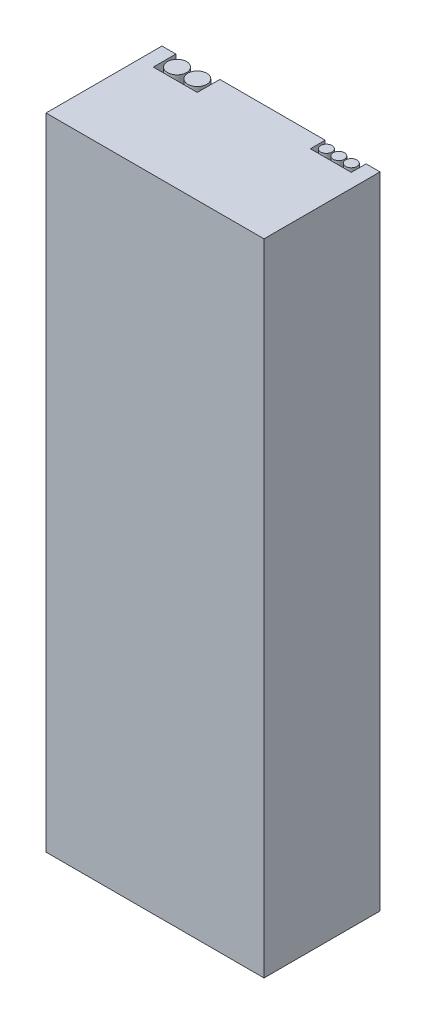
ISO-10303-21;
HEADER;
FILE_DESCRIPTION(('STEP AP214'),'2;1');
FILE_NAME('part.step','',(''),(''),'','','');
FILE_SCHEMA(('AUTOMOTIVE_DESIGN { 1 0 10303 214 1 1 1 1 }'));
ENDSEC;
DATA;
#1=APPLICATION_CONTEXT('core data for automotive mechanical design processes');
#2=APPLICATION_PROTOCOL_DEFINITION('international standard','automotive_design',2000,#1);
#3=PRODUCT_CONTEXT('',#1,'mechanical');
#4=PRODUCT('Part','Part','',(#3));
#5=PRODUCT_RELATED_PRODUCT_CATEGORY('part','',(#4));
#6=PRODUCT_DEFINITION_FORMATION('','',#4);
#7=PRODUCT_DEFINITION_CONTEXT('part definition',#1,'design');
#8=PRODUCT_DEFINITION('design','',#6,#7);
#9=PRODUCT_DEFINITION_SHAPE('','',#8);
#10=(LENGTH_UNIT() NAMED_UNIT(*) SI_UNIT(.MILLI.,.METRE.));
#11=(NAMED_UNIT(*) PLANE_ANGLE_UNIT() SI_UNIT($,.RADIAN.));
#12=(NAMED_UNIT(*) SI_UNIT($,.STERADIAN.) SOLID_ANGLE_UNIT());
#13=UNCERTAINTY_MEASURE_WITH_UNIT(LENGTH_MEASURE(1.E-05),#10,'distance_accuracy_value','');
#14=(GEOMETRIC_REPRESENTATION_CONTEXT(3) GLOBAL_UNCERTAINTY_ASSIGNED_CONTEXT((#13)) GLOBAL_UNIT_ASSIGNED_CONTEXT((#10,
#11,#12)) REPRESENTATION_CONTEXT('',''));
#15=CARTESIAN_POINT('',(0.,0.,0.));
#16=DIRECTION('',(0.,0.,1.));
#17=DIRECTION('',(1.,0.,0.));
#18=AXIS2_PLACEMENT_3D('',#15,#16,#17);
#19=CARTESIAN_POINT('',(0.,138.,-25.));
#20=DIRECTION('',(0.,0.,1.));
#21=DIRECTION('',(1.,0.,0.));
#22=AXIS2_PLACEMENT_3D('',#19,#20,#21);
#23=PLANE('',#22);
#24=DIRECTION('',(0.,1.,0.));
#25=VECTOR('',#24,1.);
#26=CARTESIAN_POINT('',(12.48,131.,-25.));
#27=LINE('',#26,#25);
#28=CARTESIAN_POINT('',(12.48,131.,-25.));
#29=VERTEX_POINT('',#28);
#30=CARTESIAN_POINT('',(12.48,138.,-25.));
#31=VERTEX_POINT('',#30);
#32=EDGE_CURVE('E231',#29,#31,#27,.T.);
#33=ORIENTED_EDGE('',*,*,#32,.T.);
#34=DIRECTION('',(-1.,0.,0.));
#35=VECTOR('',#34,1.);
#36=CARTESIAN_POINT('',(0.,138.,-25.));
#37=LINE('',#36,#35);
#38=CARTESIAN_POINT('',(35.18,138.,-25.));
#39=VERTEX_POINT('',#38);
#40=EDGE_CURVE('E352',#39,#31,#37,.T.);
#41=ORIENTED_EDGE('',*,*,#40,.F.);
#42=DIRECTION('',(0.,1.,0.));
#43=VECTOR('',#42,1.);
#44=CARTESIAN_POINT('',(35.18,131.,-25.));
#45=LINE('',#44,#43);
#46=CARTESIAN_POINT('',(35.18,131.,-25.));
#47=VERTEX_POINT('',#46);
#48=EDGE_CURVE('E150',#47,#39,#45,.T.);
#49=ORIENTED_EDGE('',*,*,#48,.F.);
#50=DIRECTION('',(-1.,0.,0.));
#51=VECTOR('',#50,1.);
#52=CARTESIAN_POINT('',(44.,131.,-25.));
#53=LINE('',#52,#51);
#54=CARTESIAN_POINT('',(44.,131.,-25.));
#55=VERTEX_POINT('',#54);
#56=EDGE_CURVE('E284',#55,#47,#53,.T.);
#57=ORIENTED_EDGE('',*,*,#56,.F.);
#58=DIRECTION('',(0.,1.,0.));
#59=VECTOR('',#58,1.);
#60=CARTESIAN_POINT('',(44.,131.,-25.));
#61=LINE('',#60,#59);
#62=CARTESIAN_POINT('',(44.,138.,-25.));
#63=VERTEX_POINT('',#62);
#64=EDGE_CURVE('E280',#55,#63,#61,.T.);
#65=ORIENTED_EDGE('',*,*,#64,.T.);
#66=CARTESIAN_POINT('',(47.,138.,-25.));
#67=VERTEX_POINT('',#66);
#68=EDGE_CURVE('E347',#67,#63,#37,.T.);
#69=ORIENTED_EDGE('',*,*,#68,.F.);
#70=DIRECTION('',(0.,-1.,0.));
#71=VECTOR('',#70,1.);
#72=CARTESIAN_POINT('',(47.,138.,-25.));
#73=LINE('',#72,#71);
#74=CARTESIAN_POINT('',(47.,0.,-25.));
#75=VERTEX_POINT('',#74);
#76=EDGE_CURVE('E367',#67,#75,#73,.T.);
#77=ORIENTED_EDGE('',*,*,#76,.T.);
#78=DIRECTION('',(-1.,0.,0.));
#79=VECTOR('',#78,1.);
#80=CARTESIAN_POINT('',(0.,0.,-25.));
#81=LINE('',#80,#79);
#82=CARTESIAN_POINT('',(0.,0.,-25.));
#83=VERTEX_POINT('',#82);
#84=EDGE_CURVE('E340',#75,#83,#81,.T.);
#85=ORIENTED_EDGE('',*,*,#84,.T.);
#86=DIRECTION('',(0.,-1.,0.));
#87=VECTOR('',#86,1.);
#88=CARTESIAN_POINT('',(0.,138.,-25.));
#89=LINE('',#88,#87);
#90=CARTESIAN_POINT('',(0.,138.,-25.));
#91=VERTEX_POINT('',#90);
#92=EDGE_CURVE('E351',#91,#83,#89,.T.);
#93=ORIENTED_EDGE('',*,*,#92,.F.);
#94=CARTESIAN_POINT('',(3.,138.,-25.));
#95=VERTEX_POINT('',#94);
#96=EDGE_CURVE('E346',#95,#91,#37,.T.);
#97=ORIENTED_EDGE('',*,*,#96,.F.);
#98=DIRECTION('',(0.,1.,0.));
#99=VECTOR('',#98,1.);
#100=CARTESIAN_POINT('',(3.,131.,-25.));
#101=LINE('',#100,#99);
#102=CARTESIAN_POINT('',(3.,131.,-25.));
#103=VERTEX_POINT('',#102);
#104=EDGE_CURVE('E142',#103,#95,#101,.T.);
#105=ORIENTED_EDGE('',*,*,#104,.F.);
#106=DIRECTION('',(1.,0.,0.));
#107=VECTOR('',#106,1.);
#108=CARTESIAN_POINT('',(3.,131.,-25.));
#109=LINE('',#108,#107);
#110=EDGE_CURVE('E223',#103,#29,#109,.T.);
#111=ORIENTED_EDGE('',*,*,#110,.T.);
#112=EDGE_LOOP('',(#33,#41,#49,#57,#65,#69,#77,#85,#93,#97,#105,#111));
#113=FACE_BOUND('',#112,.T.);
#114=ADVANCED_FACE('F126',(#113),#23,.F.);
#115=CARTESIAN_POINT('',(0.,138.,0.));
#116=DIRECTION('',(0.,-1.,0.));
#117=DIRECTION('',(0.,0.,-1.));
#118=AXIS2_PLACEMENT_3D('',#115,#116,#117);
#119=PLANE('',#118);
#120=DIRECTION('',(0.,0.,1.));
#121=VECTOR('',#120,1.);
#122=CARTESIAN_POINT('',(12.48,138.,-25.));
#123=LINE('',#122,#121);
#124=CARTESIAN_POINT('',(12.48,138.,-20.135));
#125=VERTEX_POINT('',#124);
#126=EDGE_CURVE('E234',#31,#125,#123,.T.);
#127=ORIENTED_EDGE('',*,*,#126,.T.);
#128=DIRECTION('',(1.,0.,0.));
#129=VECTOR('',#128,1.);
#130=CARTESIAN_POINT('',(3.,138.,-20.135));
#131=LINE('',#130,#129);
#132=CARTESIAN_POINT('',(3.,138.,-20.135));
#133=VERTEX_POINT('',#132);
#134=EDGE_CURVE('E247',#133,#125,#131,.T.);
#135=ORIENTED_EDGE('',*,*,#134,.F.);
#136=DIRECTION('',(0.,0.,1.));
#137=VECTOR('',#136,1.);
#138=CARTESIAN_POINT('',(3.,138.,-25.));
#139=LINE('',#138,#137);
#140=EDGE_CURVE('E244',#95,#133,#139,.T.);
#141=ORIENTED_EDGE('',*,*,#140,.F.);
#142=ORIENTED_EDGE('',*,*,#96,.T.);
#143=DIRECTION('',(0.,0.,1.));
#144=VECTOR('',#143,1.);
#145=CARTESIAN_POINT('',(0.,138.,0.));
#146=LINE('',#145,#144);
#147=CARTESIAN_POINT('',(0.,138.,0.));
#148=VERTEX_POINT('',#147);
#149=EDGE_CURVE('E335',#91,#148,#146,.T.);
#150=ORIENTED_EDGE('',*,*,#149,.T.);
#151=DIRECTION('',(1.,0.,0.));
#152=VECTOR('',#151,1.);
#153=CARTESIAN_POINT('',(0.,138.,0.));
#154=LINE('',#153,#152);
#155=CARTESIAN_POINT('',(47.,138.,0.));
#156=VERTEX_POINT('',#155);
#157=EDGE_CURVE('E339',#148,#156,#154,.T.);
#158=ORIENTED_EDGE('',*,*,#157,.T.);
#159=DIRECTION('',(0.,0.,-1.));
#160=VECTOR('',#159,1.);
#161=CARTESIAN_POINT('',(47.,138.,0.));
#162=LINE('',#161,#160);
#163=EDGE_CURVE('E343',#156,#67,#162,.T.);
#164=ORIENTED_EDGE('',*,*,#163,.T.);
#165=ORIENTED_EDGE('',*,*,#68,.T.);
#166=DIRECTION('',(0.,0.,1.));
#167=VECTOR('',#166,1.);
#168=CARTESIAN_POINT('',(44.,138.,-25.));
#169=LINE('',#168,#167);
#170=CARTESIAN_POINT('',(44.,138.,-21.81));
#171=VERTEX_POINT('',#170);
#172=EDGE_CURVE('E293',#63,#171,#169,.T.);
#173=ORIENTED_EDGE('',*,*,#172,.T.);
#174=DIRECTION('',(-1.,0.,0.));
#175=VECTOR('',#174,1.);
#176=CARTESIAN_POINT('',(44.,138.,-21.81));
#177=LINE('',#176,#175);
#178=CARTESIAN_POINT('',(35.18,138.,-21.81));
#179=VERTEX_POINT('',#178);
#180=EDGE_CURVE('E288',#171,#179,#177,.T.);
#181=ORIENTED_EDGE('',*,*,#180,.T.);
#182=DIRECTION('',(0.,0.,1.));
#183=VECTOR('',#182,1.);
#184=CARTESIAN_POINT('',(35.18,138.,-25.));
#185=LINE('',#184,#183);
#186=EDGE_CURVE('E285',#39,#179,#185,.T.);
#187=ORIENTED_EDGE('',*,*,#186,.F.);
#188=ORIENTED_EDGE('',*,*,#40,.T.);
#189=EDGE_LOOP('',(#127,#135,#141,#142,#150,#158,#164,#165,#173,#181,#187,#188));
#190=FACE_BOUND('',#189,.T.);
#191=ADVANCED_FACE('F389',(#190),#119,.F.);
#192=CARTESIAN_POINT('',(0.,138.,0.));
#193=DIRECTION('',(1.,0.,0.));
#194=DIRECTION('',(0.,0.,-1.));
#195=AXIS2_PLACEMENT_3D('',#192,#193,#194);
#196=PLANE('',#195);
#197=DIRECTION('',(0.,0.,1.));
#198=VECTOR('',#197,1.);
#199=CARTESIAN_POINT('',(0.,0.,0.));
#200=LINE('',#199,#198);
#201=CARTESIAN_POINT('',(0.,0.,0.));
#202=VERTEX_POINT('',#201);
#203=EDGE_CURVE('E239',#83,#202,#200,.T.);
#204=ORIENTED_EDGE('',*,*,#203,.T.);
#205=DIRECTION('',(0.,-1.,0.));
#206=VECTOR('',#205,1.);
#207=CARTESIAN_POINT('',(0.,138.,0.));
#208=LINE('',#207,#206);
#209=EDGE_CURVE('E12',#148,#202,#208,.T.);
#210=ORIENTED_EDGE('',*,*,#209,.F.);
#211=ORIENTED_EDGE('',*,*,#149,.F.);
#212=ORIENTED_EDGE('',*,*,#92,.T.);
#213=EDGE_LOOP('',(#204,#210,#211,#212));
#214=FACE_BOUND('',#213,.T.);
#215=ADVANCED_FACE('F128',(#214),#196,.F.);
#216=CARTESIAN_POINT('',(0.,138.,0.));
#217=DIRECTION('',(0.,0.,-1.));
#218=DIRECTION('',(-1.,0.,0.));
#219=AXIS2_PLACEMENT_3D('',#216,#217,#218);
#220=PLANE('',#219);
#221=DIRECTION('',(1.,0.,0.));
#222=VECTOR('',#221,1.);
#223=CARTESIAN_POINT('',(0.,0.,0.));
#224=LINE('',#223,#222);
#225=CARTESIAN_POINT('',(47.,0.,0.));
#226=VERTEX_POINT('',#225);
#227=EDGE_CURVE('E356',#202,#226,#224,.T.);
#228=ORIENTED_EDGE('',*,*,#227,.T.);
#229=DIRECTION('',(0.,-1.,0.));
#230=VECTOR('',#229,1.);
#231=CARTESIAN_POINT('',(47.,138.,0.));
#232=LINE('',#231,#230);
#233=EDGE_CURVE('E135',#156,#226,#232,.T.);
#234=ORIENTED_EDGE('',*,*,#233,.F.);
#235=ORIENTED_EDGE('',*,*,#157,.F.);
#236=ORIENTED_EDGE('',*,*,#209,.T.);
#237=EDGE_LOOP('',(#228,#234,#235,#236));
#238=FACE_BOUND('',#237,.T.);
#239=ADVANCED_FACE('F425',(#238),#220,.F.);
#240=CARTESIAN_POINT('',(47.,138.,0.));
#241=DIRECTION('',(-1.,0.,0.));
#242=DIRECTION('',(0.,0.,1.));
#243=AXIS2_PLACEMENT_3D('',#240,#241,#242);
#244=PLANE('',#243);
#245=DIRECTION('',(0.,0.,-1.));
#246=VECTOR('',#245,1.);
#247=CARTESIAN_POINT('',(47.,0.,0.));
#248=LINE('',#247,#246);
#249=EDGE_CURVE('E359',#226,#75,#248,.T.);
#250=ORIENTED_EDGE('',*,*,#249,.T.);
#251=ORIENTED_EDGE('',*,*,#76,.F.);
#252=ORIENTED_EDGE('',*,*,#163,.F.);
#253=ORIENTED_EDGE('',*,*,#233,.T.);
#254=EDGE_LOOP('',(#250,#251,#252,#253));
#255=FACE_BOUND('',#254,.T.);
#256=ADVANCED_FACE('F376',(#255),#244,.F.);
#257=CARTESIAN_POINT('',(0.,0.,0.));
#258=DIRECTION('',(0.,-1.,0.));
#259=DIRECTION('',(0.,0.,-1.));
#260=AXIS2_PLACEMENT_3D('',#257,#258,#259);
#261=PLANE('',#260);
#262=ORIENTED_EDGE('',*,*,#203,.F.);
#263=ORIENTED_EDGE('',*,*,#84,.F.);
#264=ORIENTED_EDGE('',*,*,#249,.F.);
#265=ORIENTED_EDGE('',*,*,#227,.F.);
#266=EDGE_LOOP('',(#262,#263,#264,#265));
#267=FACE_BOUND('',#266,.T.);
#268=ADVANCED_FACE('F382',(#267),#261,.T.);
#269=CARTESIAN_POINT('',(44.,131.,-25.));
#270=DIRECTION('',(-1.,0.,0.));
#271=DIRECTION('',(0.,0.,1.));
#272=AXIS2_PLACEMENT_3D('',#269,#270,#271);
#273=PLANE('',#272);
#274=ORIENTED_EDGE('',*,*,#172,.F.);
#275=ORIENTED_EDGE('',*,*,#64,.F.);
#276=DIRECTION('',(0.,0.,1.));
#277=VECTOR('',#276,1.);
#278=CARTESIAN_POINT('',(44.,131.,-25.));
#279=LINE('',#278,#277);
#280=CARTESIAN_POINT('',(44.,131.,-21.81));
#281=VERTEX_POINT('',#280);
#282=EDGE_CURVE('E289',#55,#281,#279,.T.);
#283=ORIENTED_EDGE('',*,*,#282,.T.);
#284=DIRECTION('',(0.,1.,0.));
#285=VECTOR('',#284,1.);
#286=CARTESIAN_POINT('',(44.,131.,-21.81));
#287=LINE('',#286,#285);
#288=EDGE_CURVE('E271',#281,#171,#287,.T.);
#289=ORIENTED_EDGE('',*,*,#288,.T.);
#290=EDGE_LOOP('',(#274,#275,#283,#289));
#291=FACE_BOUND('',#290,.T.);
#292=ADVANCED_FACE('F399',(#291),#273,.T.);
#293=CARTESIAN_POINT('',(44.,131.,-21.81));
#294=DIRECTION('',(0.,0.,-1.));
#295=DIRECTION('',(-1.,0.,0.));
#296=AXIS2_PLACEMENT_3D('',#293,#294,#295);
#297=PLANE('',#296);
#298=ORIENTED_EDGE('',*,*,#180,.F.);
#299=ORIENTED_EDGE('',*,*,#288,.F.);
#300=DIRECTION('',(-1.,0.,0.));
#301=VECTOR('',#300,1.);
#302=CARTESIAN_POINT('',(44.,131.,-21.81));
#303=LINE('',#302,#301);
#304=CARTESIAN_POINT('',(35.18,131.,-21.81));
#305=VERTEX_POINT('',#304);
#306=EDGE_CURVE('E305',#281,#305,#303,.T.);
#307=ORIENTED_EDGE('',*,*,#306,.T.);
#308=DIRECTION('',(0.,1.,0.));
#309=VECTOR('',#308,1.);
#310=CARTESIAN_POINT('',(35.18,131.,-21.81));
#311=LINE('',#310,#309);
#312=EDGE_CURVE('E275',#305,#179,#311,.T.);
#313=ORIENTED_EDGE('',*,*,#312,.T.);
#314=EDGE_LOOP('',(#298,#299,#307,#313));
#315=FACE_BOUND('',#314,.T.);
#316=ADVANCED_FACE('F401',(#315),#297,.T.);
#317=CARTESIAN_POINT('',(35.18,131.,-25.));
#318=DIRECTION('',(-1.,0.,0.));
#319=DIRECTION('',(0.,0.,1.));
#320=AXIS2_PLACEMENT_3D('',#317,#318,#319);
#321=PLANE('',#320);
#322=ORIENTED_EDGE('',*,*,#186,.T.);
#323=ORIENTED_EDGE('',*,*,#312,.F.);
#324=DIRECTION('',(0.,0.,1.));
#325=VECTOR('',#324,1.);
#326=CARTESIAN_POINT('',(35.18,131.,-25.));
#327=LINE('',#326,#325);
#328=EDGE_CURVE('E301',#47,#305,#327,.T.);
#329=ORIENTED_EDGE('',*,*,#328,.F.);
#330=ORIENTED_EDGE('',*,*,#48,.T.);
#331=EDGE_LOOP('',(#322,#323,#329,#330));
#332=FACE_BOUND('',#331,.T.);
#333=ADVANCED_FACE('F403',(#332),#321,.F.);
#334=CARTESIAN_POINT('',(0.,131.,0.));
#335=DIRECTION('',(0.,-1.,0.));
#336=DIRECTION('',(0.,0.,-1.));
#337=AXIS2_PLACEMENT_3D('',#334,#335,#336);
#338=PLANE('',#337);
#339=CARTESIAN_POINT('',(42.28,131.,-23.53));
#340=DIRECTION('',(0.,1.,0.));
#341=DIRECTION('',(0.,0.,1.));
#342=AXIS2_PLACEMENT_3D('',#339,#340,#341);
#343=CIRCLE('',#342,1.22);
#344=CARTESIAN_POINT('',(42.28,131.,-22.31));
#345=VERTEX_POINT('',#344);
#346=EDGE_CURVE('E323',#345,#345,#343,.T.);
#347=ORIENTED_EDGE('',*,*,#346,.F.);
#348=EDGE_LOOP('',(#347));
#349=FACE_BOUND('',#348,.T.);
#350=CARTESIAN_POINT('',(39.59,131.,-23.53));
#351=DIRECTION('',(0.,1.,0.));
#352=DIRECTION('',(0.,0.,1.));
#353=AXIS2_PLACEMENT_3D('',#350,#351,#352);
#354=CIRCLE('',#353,1.22);
#355=CARTESIAN_POINT('',(39.59,131.,-22.31));
#356=VERTEX_POINT('',#355);
#357=EDGE_CURVE('E315',#356,#356,#354,.T.);
#358=ORIENTED_EDGE('',*,*,#357,.F.);
#359=EDGE_LOOP('',(#358));
#360=FACE_BOUND('',#359,.T.);
#361=CARTESIAN_POINT('',(36.9,131.,-23.53));
#362=DIRECTION('',(0.,1.,0.));
#363=DIRECTION('',(0.,0.,1.));
#364=AXIS2_PLACEMENT_3D('',#361,#362,#363);
#365=CIRCLE('',#364,1.22);
#366=CARTESIAN_POINT('',(36.9,131.,-22.31));
#367=VERTEX_POINT('',#366);
#368=EDGE_CURVE('E297',#367,#367,#365,.T.);
#369=ORIENTED_EDGE('',*,*,#368,.F.);
#370=EDGE_LOOP('',(#369));
#371=FACE_BOUND('',#370,.T.);
#372=ORIENTED_EDGE('',*,*,#282,.F.);
#373=ORIENTED_EDGE('',*,*,#56,.T.);
#374=ORIENTED_EDGE('',*,*,#328,.T.);
#375=ORIENTED_EDGE('',*,*,#306,.F.);
#376=EDGE_LOOP('',(#372,#373,#374,#375));
#377=FACE_BOUND('',#376,.T.);
#378=ADVANCED_FACE('F396',(#349,#360,#371,#377),#338,.F.);
#379=CARTESIAN_POINT('',(36.9,131.,-23.53));
#380=DIRECTION('',(0.,1.,0.));
#381=DIRECTION('',(0.,0.,1.));
#382=AXIS2_PLACEMENT_3D('',#379,#380,#381);
#383=CYLINDRICAL_SURFACE('',#382,1.22);
#384=ORIENTED_EDGE('',*,*,#368,.T.);
#385=EDGE_LOOP('',(#384));
#386=FACE_BOUND('',#385,.T.);
#387=CARTESIAN_POINT('',(36.9,138.,-23.53));
#388=DIRECTION('',(0.,1.,0.));
#389=DIRECTION('',(0.,0.,1.));
#390=AXIS2_PLACEMENT_3D('',#387,#388,#389);
#391=CIRCLE('',#390,1.22);
#392=CARTESIAN_POINT('',(36.9,138.,-22.31));
#393=VERTEX_POINT('',#392);
#394=EDGE_CURVE('E311',#393,#393,#391,.T.);
#395=ORIENTED_EDGE('',*,*,#394,.F.);
#396=EDGE_LOOP('',(#395));
#397=FACE_BOUND('',#396,.T.);
#398=ADVANCED_FACE('F410',(#386,#397),#383,.T.);
#399=CARTESIAN_POINT('',(39.59,131.,-23.53));
#400=DIRECTION('',(0.,1.,0.));
#401=DIRECTION('',(0.,0.,1.));
#402=AXIS2_PLACEMENT_3D('',#399,#400,#401);
#403=CYLINDRICAL_SURFACE('',#402,1.22);
#404=ORIENTED_EDGE('',*,*,#357,.T.);
#405=EDGE_LOOP('',(#404));
#406=FACE_BOUND('',#405,.T.);
#407=CARTESIAN_POINT('',(39.59,138.,-23.53));
#408=DIRECTION('',(0.,1.,0.));
#409=DIRECTION('',(0.,0.,1.));
#410=AXIS2_PLACEMENT_3D('',#407,#408,#409);
#411=CIRCLE('',#410,1.22);
#412=CARTESIAN_POINT('',(39.59,138.,-22.31));
#413=VERTEX_POINT('',#412);
#414=EDGE_CURVE('E319',#413,#413,#411,.T.);
#415=ORIENTED_EDGE('',*,*,#414,.F.);
#416=EDGE_LOOP('',(#415));
#417=FACE_BOUND('',#416,.T.);
#418=ADVANCED_FACE('F562',(#406,#417),#403,.T.);
#419=CARTESIAN_POINT('',(42.28,131.,-23.53));
#420=DIRECTION('',(0.,1.,0.));
#421=DIRECTION('',(0.,0.,1.));
#422=AXIS2_PLACEMENT_3D('',#419,#420,#421);
#423=CYLINDRICAL_SURFACE('',#422,1.22);
#424=ORIENTED_EDGE('',*,*,#346,.T.);
#425=EDGE_LOOP('',(#424));
#426=FACE_BOUND('',#425,.T.);
#427=CARTESIAN_POINT('',(42.28,138.,-23.53));
#428=DIRECTION('',(0.,1.,0.));
#429=DIRECTION('',(0.,0.,1.));
#430=AXIS2_PLACEMENT_3D('',#427,#428,#429);
#431=CIRCLE('',#430,1.22);
#432=CARTESIAN_POINT('',(42.28,138.,-22.31));
#433=VERTEX_POINT('',#432);
#434=EDGE_CURVE('E327',#433,#433,#431,.T.);
#435=ORIENTED_EDGE('',*,*,#434,.F.);
#436=EDGE_LOOP('',(#435));
#437=FACE_BOUND('',#436,.T.);
#438=ADVANCED_FACE('F553',(#426,#437),#423,.T.);
#439=ORIENTED_EDGE('',*,*,#414,.T.);
#440=EDGE_LOOP('',(#439));
#441=FACE_BOUND('',#440,.T.);
#442=ADVANCED_FACE('F543',(#441),#119,.F.);
#443=ORIENTED_EDGE('',*,*,#394,.T.);
#444=EDGE_LOOP('',(#443));
#445=FACE_BOUND('',#444,.T.);
#446=ADVANCED_FACE('F461',(#445),#119,.F.);
#447=CARTESIAN_POINT('',(12.48,131.,-25.));
#448=DIRECTION('',(-1.,0.,0.));
#449=DIRECTION('',(0.,0.,1.));
#450=AXIS2_PLACEMENT_3D('',#447,#448,#449);
#451=PLANE('',#450);
#452=ORIENTED_EDGE('',*,*,#126,.F.);
#453=ORIENTED_EDGE('',*,*,#32,.F.);
#454=DIRECTION('',(0.,0.,1.));
#455=VECTOR('',#454,1.);
#456=CARTESIAN_POINT('',(12.48,131.,-25.));
#457=LINE('',#456,#455);
#458=CARTESIAN_POINT('',(12.48,131.,-20.135));
#459=VERTEX_POINT('',#458);
#460=EDGE_CURVE('E218',#29,#459,#457,.T.);
#461=ORIENTED_EDGE('',*,*,#460,.T.);
#462=DIRECTION('',(0.,1.,0.));
#463=VECTOR('',#462,1.);
#464=CARTESIAN_POINT('',(12.48,131.,-20.135));
#465=LINE('',#464,#463);
#466=EDGE_CURVE('E240',#459,#125,#465,.T.);
#467=ORIENTED_EDGE('',*,*,#466,.T.);
#468=EDGE_LOOP('',(#452,#453,#461,#467));
#469=FACE_BOUND('',#468,.T.);
#470=ADVANCED_FACE('F232',(#469),#451,.T.);
#471=CARTESIAN_POINT('',(3.,131.,-20.135));
#472=DIRECTION('',(0.,0.,1.));
#473=DIRECTION('',(1.,0.,0.));
#474=AXIS2_PLACEMENT_3D('',#471,#472,#473);
#475=PLANE('',#474);
#476=ORIENTED_EDGE('',*,*,#134,.T.);
#477=ORIENTED_EDGE('',*,*,#466,.F.);
#478=DIRECTION('',(1.,0.,0.));
#479=VECTOR('',#478,1.);
#480=CARTESIAN_POINT('',(3.,131.,-20.135));
#481=LINE('',#480,#479);
#482=CARTESIAN_POINT('',(3.,131.,-20.135));
#483=VERTEX_POINT('',#482);
#484=EDGE_CURVE('E225',#483,#459,#481,.T.);
#485=ORIENTED_EDGE('',*,*,#484,.F.);
#486=DIRECTION('',(0.,1.,0.));
#487=VECTOR('',#486,1.);
#488=CARTESIAN_POINT('',(3.,131.,-20.135));
#489=LINE('',#488,#487);
#490=EDGE_CURVE('E266',#483,#133,#489,.T.);
#491=ORIENTED_EDGE('',*,*,#490,.T.);
#492=EDGE_LOOP('',(#476,#477,#485,#491));
#493=FACE_BOUND('',#492,.T.);
#494=ADVANCED_FACE('F506',(#493),#475,.F.);
#495=CARTESIAN_POINT('',(3.,131.,-25.));
#496=DIRECTION('',(-1.,0.,0.));
#497=DIRECTION('',(0.,0.,1.));
#498=AXIS2_PLACEMENT_3D('',#495,#496,#497);
#499=PLANE('',#498);
#500=ORIENTED_EDGE('',*,*,#140,.T.);
#501=ORIENTED_EDGE('',*,*,#490,.F.);
#502=DIRECTION('',(0.,0.,1.));
#503=VECTOR('',#502,1.);
#504=CARTESIAN_POINT('',(3.,131.,-25.));
#505=LINE('',#504,#503);
#506=EDGE_CURVE('E255',#103,#483,#505,.T.);
#507=ORIENTED_EDGE('',*,*,#506,.F.);
#508=ORIENTED_EDGE('',*,*,#104,.T.);
#509=EDGE_LOOP('',(#500,#501,#507,#508));
#510=FACE_BOUND('',#509,.T.);
#511=ADVANCED_FACE('F500',(#510),#499,.F.);
#512=CARTESIAN_POINT('',(0.,131.,0.));
#513=DIRECTION('',(0.,-1.,0.));
#514=DIRECTION('',(0.,0.,-1.));
#515=AXIS2_PLACEMENT_3D('',#512,#513,#514);
#516=PLANE('',#515);
#517=CARTESIAN_POINT('',(9.9225,131.,-22.6925));
#518=DIRECTION('',(0.,1.,0.));
#519=DIRECTION('',(0.,0.,1.));
#520=AXIS2_PLACEMENT_3D('',#517,#518,#519);
#521=CIRCLE('',#520,2.0575);
#522=CARTESIAN_POINT('',(9.9225,131.,-20.635));
#523=VERTEX_POINT('',#522);
#524=EDGE_CURVE('E773',#523,#523,#521,.T.);
#525=ORIENTED_EDGE('',*,*,#524,.F.);
#526=EDGE_LOOP('',(#525));
#527=FACE_BOUND('',#526,.T.);
#528=CARTESIAN_POINT('',(5.5575,131.,-22.6925));
#529=DIRECTION('',(0.,1.,0.));
#530=DIRECTION('',(0.,0.,1.));
#531=AXIS2_PLACEMENT_3D('',#528,#529,#530);
#532=CIRCLE('',#531,2.0575);
#533=CARTESIAN_POINT('',(5.5575,131.,-20.635));
#534=VERTEX_POINT('',#533);
#535=EDGE_CURVE('E260',#534,#534,#532,.T.);
#536=ORIENTED_EDGE('',*,*,#535,.F.);
#537=EDGE_LOOP('',(#536));
#538=FACE_BOUND('',#537,.T.);
#539=ORIENTED_EDGE('',*,*,#110,.F.);
#540=ORIENTED_EDGE('',*,*,#506,.T.);
#541=ORIENTED_EDGE('',*,*,#484,.T.);
#542=ORIENTED_EDGE('',*,*,#460,.F.);
#543=EDGE_LOOP('',(#539,#540,#541,#542));
#544=FACE_BOUND('',#543,.T.);
#545=ADVANCED_FACE('F220',(#527,#538,#544),#516,.F.);
#546=CARTESIAN_POINT('',(5.5575,131.,-22.6925));
#547=DIRECTION('',(0.,1.,0.));
#548=DIRECTION('',(0.,0.,1.));
#549=AXIS2_PLACEMENT_3D('',#546,#547,#548);
#550=CYLINDRICAL_SURFACE('',#549,2.0575);
#551=ORIENTED_EDGE('',*,*,#535,.T.);
#552=EDGE_LOOP('',(#551));
#553=FACE_BOUND('',#552,.T.);
#554=CARTESIAN_POINT('',(5.5575,138.,-22.6925));
#555=DIRECTION('',(0.,1.,0.));
#556=DIRECTION('',(0.,0.,1.));
#557=AXIS2_PLACEMENT_3D('',#554,#555,#556);
#558=CIRCLE('',#557,2.0575);
#559=CARTESIAN_POINT('',(5.5575,138.,-20.635));
#560=VERTEX_POINT('',#559);
#561=EDGE_CURVE('E250',#560,#560,#558,.T.);
#562=ORIENTED_EDGE('',*,*,#561,.F.);
#563=EDGE_LOOP('',(#562));
#564=FACE_BOUND('',#563,.T.);
#565=ADVANCED_FACE('F473',(#553,#564),#550,.T.);
#566=CARTESIAN_POINT('',(9.9225,131.,-22.6925));
#567=DIRECTION('',(0.,1.,0.));
#568=DIRECTION('',(0.,0.,1.));
#569=AXIS2_PLACEMENT_3D('',#566,#567,#568);
#570=CYLINDRICAL_SURFACE('',#569,2.0575);
#571=ORIENTED_EDGE('',*,*,#524,.T.);
#572=EDGE_LOOP('',(#571));
#573=FACE_BOUND('',#572,.T.);
#574=CARTESIAN_POINT('',(9.9225,138.,-22.6925));
#575=DIRECTION('',(0.,1.,0.));
#576=DIRECTION('',(0.,0.,1.));
#577=AXIS2_PLACEMENT_3D('',#574,#575,#576);
#578=CIRCLE('',#577,2.0575);
#579=CARTESIAN_POINT('',(9.9225,138.,-20.635));
#580=VERTEX_POINT('',#579);
#581=EDGE_CURVE('E331',#580,#580,#578,.T.);
#582=ORIENTED_EDGE('',*,*,#581,.F.);
#583=EDGE_LOOP('',(#582));
#584=FACE_BOUND('',#583,.T.);
#585=ADVANCED_FACE('F467',(#573,#584),#570,.T.);
#586=ORIENTED_EDGE('',*,*,#561,.T.);
#587=EDGE_LOOP('',(#586));
#588=FACE_BOUND('',#587,.T.);
#589=ADVANCED_FACE('F420',(#588),#119,.F.);
#590=ORIENTED_EDGE('',*,*,#434,.T.);
#591=EDGE_LOOP('',(#590));
#592=FACE_BOUND('',#591,.T.);
#593=ADVANCED_FACE('F421',(#592),#119,.F.);
#594=ORIENTED_EDGE('',*,*,#581,.T.);
#595=EDGE_LOOP('',(#594));
#596=FACE_BOUND('',#595,.T.);
#597=ADVANCED_FACE('F454',(#596),#119,.F.);
#598=CLOSED_SHELL('',(#114,#191,#215,#239,#256,#268,#292,#316,#333,#378,#398,#418,#438,#442,
#446,#470,#494,#511,#545,#565,#585,#589,#593,#597));
#599=MANIFOLD_SOLID_BREP('B2',#598);
#600=ADVANCED_BREP_SHAPE_REPRESENTATION('',(#18,#599),#14);
#601=SHAPE_DEFINITION_REPRESENTATION(#9,#600);
ENDSEC;
END-ISO-10303-21;
